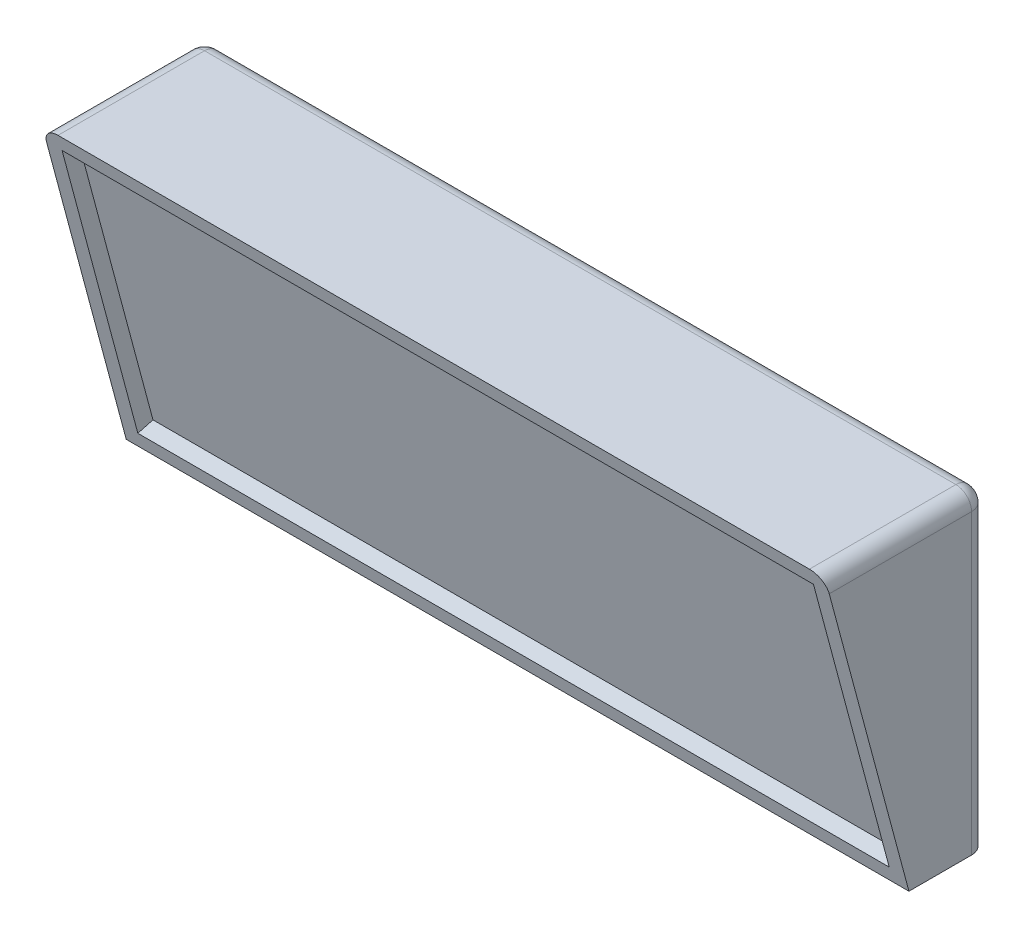
ISO-10303-21;
HEADER;
FILE_DESCRIPTION(('STEP AP214'),'2;1');
FILE_NAME('part.step','',(''),(''),'','','');
FILE_SCHEMA(('AUTOMOTIVE_DESIGN { 1 0 10303 214 1 1 1 1 }'));
ENDSEC;
DATA;
#1=APPLICATION_CONTEXT('core data for automotive mechanical design processes');
#2=APPLICATION_PROTOCOL_DEFINITION('international standard','automotive_design',2000,#1);
#3=PRODUCT_CONTEXT('',#1,'mechanical');
#4=PRODUCT('Part','Part','',(#3));
#5=PRODUCT_RELATED_PRODUCT_CATEGORY('part','',(#4));
#6=PRODUCT_DEFINITION_FORMATION('','',#4);
#7=PRODUCT_DEFINITION_CONTEXT('part definition',#1,'design');
#8=PRODUCT_DEFINITION('design','',#6,#7);
#9=PRODUCT_DEFINITION_SHAPE('','',#8);
#10=(LENGTH_UNIT() NAMED_UNIT(*) SI_UNIT(.MILLI.,.METRE.));
#11=(NAMED_UNIT(*) PLANE_ANGLE_UNIT() SI_UNIT($,.RADIAN.));
#12=(NAMED_UNIT(*) SI_UNIT($,.STERADIAN.) SOLID_ANGLE_UNIT());
#13=UNCERTAINTY_MEASURE_WITH_UNIT(LENGTH_MEASURE(1.E-05),#10,'distance_accuracy_value','');
#14=(GEOMETRIC_REPRESENTATION_CONTEXT(3) GLOBAL_UNCERTAINTY_ASSIGNED_CONTEXT((#13)) GLOBAL_UNIT_ASSIGNED_CONTEXT((#10,
#11,#12)) REPRESENTATION_CONTEXT('',''));
#15=CARTESIAN_POINT('',(0.,0.,0.));
#16=DIRECTION('',(0.,0.,1.));
#17=DIRECTION('',(1.,0.,0.));
#18=AXIS2_PLACEMENT_3D('',#15,#16,#17);
#19=CARTESIAN_POINT('',(63.5,0.,12.7));
#20=DIRECTION('',(0.,1.,0.));
#21=DIRECTION('',(0.,0.,1.));
#22=AXIS2_PLACEMENT_3D('',#19,#20,#21);
#23=PLANE('',#22);
#24=DIRECTION('',(0.,0.,-1.));
#25=VECTOR('',#24,1.);
#26=CARTESIAN_POINT('',(-63.5,0.,12.7));
#27=LINE('',#26,#25);
#28=CARTESIAN_POINT('',(-63.5,0.,12.7));
#29=VERTEX_POINT('',#28);
#30=CARTESIAN_POINT('',(-63.5,0.,2.54));
#31=VERTEX_POINT('',#30);
#32=EDGE_CURVE('E187',#29,#31,#27,.T.);
#33=ORIENTED_EDGE('',*,*,#32,.T.);
#34=CARTESIAN_POINT('',(-60.96,0.,2.54));
#35=DIRECTION('',(0.,1.,0.));
#36=DIRECTION('',(0.,0.,1.));
#37=AXIS2_PLACEMENT_3D('',#34,#35,#36);
#38=CIRCLE('',#37,2.54);
#39=CARTESIAN_POINT('',(-60.96,0.,0.));
#40=VERTEX_POINT('',#39);
#41=EDGE_CURVE('E237',#31,#40,#38,.F.);
#42=ORIENTED_EDGE('',*,*,#41,.T.);
#43=DIRECTION('',(-1.,0.,0.));
#44=VECTOR('',#43,1.);
#45=CARTESIAN_POINT('',(63.5,0.,0.));
#46=LINE('',#45,#44);
#47=CARTESIAN_POINT('',(60.96,0.,0.));
#48=VERTEX_POINT('',#47);
#49=EDGE_CURVE('E214',#48,#40,#46,.T.);
#50=ORIENTED_EDGE('',*,*,#49,.F.);
#51=CARTESIAN_POINT('',(60.96,0.,2.54));
#52=DIRECTION('',(0.,1.,0.));
#53=DIRECTION('',(0.,0.,1.));
#54=AXIS2_PLACEMENT_3D('',#51,#52,#53);
#55=CIRCLE('',#54,2.54);
#56=CARTESIAN_POINT('',(63.5,0.,2.54));
#57=VERTEX_POINT('',#56);
#58=EDGE_CURVE('E234',#48,#57,#55,.F.);
#59=ORIENTED_EDGE('',*,*,#58,.T.);
#60=DIRECTION('',(0.,0.,-1.));
#61=VECTOR('',#60,1.);
#62=CARTESIAN_POINT('',(63.5,0.,12.7));
#63=LINE('',#62,#61);
#64=CARTESIAN_POINT('',(63.5,0.,12.7));
#65=VERTEX_POINT('',#64);
#66=EDGE_CURVE('E193',#65,#57,#63,.T.);
#67=ORIENTED_EDGE('',*,*,#66,.F.);
#68=DIRECTION('',(-1.,0.,0.));
#69=VECTOR('',#68,1.);
#70=CARTESIAN_POINT('',(63.5,0.,12.7));
#71=LINE('',#70,#69);
#72=EDGE_CURVE('E201',#65,#29,#71,.T.);
#73=ORIENTED_EDGE('',*,*,#72,.T.);
#74=EDGE_LOOP('',(#33,#42,#50,#59,#67,#73));
#75=FACE_BOUND('',#74,.T.);
#76=ADVANCED_FACE('F47',(#75),#23,.F.);
#77=CARTESIAN_POINT('',(63.5,0.,0.));
#78=DIRECTION('',(0.,0.,1.));
#79=DIRECTION('',(1.,0.,0.));
#80=AXIS2_PLACEMENT_3D('',#77,#78,#79);
#81=PLANE('',#80);
#82=ORIENTED_EDGE('',*,*,#49,.T.);
#83=DIRECTION('',(0.,1.,0.));
#84=VECTOR('',#83,1.);
#85=CARTESIAN_POINT('',(-60.96,0.,0.));
#86=LINE('',#85,#84);
#87=CARTESIAN_POINT('',(-60.96,48.26,0.));
#88=VERTEX_POINT('',#87);
#89=EDGE_CURVE('E224',#40,#88,#86,.T.);
#90=ORIENTED_EDGE('',*,*,#89,.T.);
#91=DIRECTION('',(-1.,0.,0.));
#92=VECTOR('',#91,1.);
#93=CARTESIAN_POINT('',(63.5,48.26,0.));
#94=LINE('',#93,#92);
#95=CARTESIAN_POINT('',(60.96,48.26,0.));
#96=VERTEX_POINT('',#95);
#97=EDGE_CURVE('E218',#88,#96,#94,.F.);
#98=ORIENTED_EDGE('',*,*,#97,.T.);
#99=DIRECTION('',(0.,1.,0.));
#100=VECTOR('',#99,1.);
#101=CARTESIAN_POINT('',(60.96,0.,0.));
#102=LINE('',#101,#100);
#103=EDGE_CURVE('E221',#96,#48,#102,.F.);
#104=ORIENTED_EDGE('',*,*,#103,.T.);
#105=EDGE_LOOP('',(#82,#90,#98,#104));
#106=FACE_BOUND('',#105,.T.);
#107=ADVANCED_FACE('F318',(#106),#81,.F.);
#108=CARTESIAN_POINT('',(63.5,50.8,0.));
#109=DIRECTION('',(0.,-1.,0.));
#110=DIRECTION('',(0.,0.,-1.));
#111=AXIS2_PLACEMENT_3D('',#108,#109,#110);
#112=PLANE('',#111);
#113=DIRECTION('',(-1.,0.,0.));
#114=VECTOR('',#113,1.);
#115=CARTESIAN_POINT('',(63.5,50.8,2.54));
#116=LINE('',#115,#114);
#117=CARTESIAN_POINT('',(60.96,50.8,2.54));
#118=VERTEX_POINT('',#117);
#119=CARTESIAN_POINT('',(-60.96,50.8,2.54));
#120=VERTEX_POINT('',#119);
#121=EDGE_CURVE('E65',#118,#120,#116,.T.);
#122=ORIENTED_EDGE('',*,*,#121,.T.);
#123=DIRECTION('',(0.,0.,1.));
#124=VECTOR('',#123,1.);
#125=CARTESIAN_POINT('',(-60.96,50.8,0.));
#126=LINE('',#125,#124);
#127=CARTESIAN_POINT('',(-60.96,50.8,26.3118189755013));
#128=VERTEX_POINT('',#127);
#129=EDGE_CURVE('E250',#120,#128,#126,.T.);
#130=ORIENTED_EDGE('',*,*,#129,.T.);
#131=DIRECTION('',(-1.,0.,0.));
#132=VECTOR('',#131,1.);
#133=CARTESIAN_POINT('',(63.5,50.8,26.3118189755013));
#134=LINE('',#133,#132);
#135=CARTESIAN_POINT('',(60.96,50.8,26.3118189755013));
#136=VERTEX_POINT('',#135);
#137=EDGE_CURVE('E210',#136,#128,#134,.T.);
#138=ORIENTED_EDGE('',*,*,#137,.F.);
#139=DIRECTION('',(0.,0.,1.));
#140=VECTOR('',#139,1.);
#141=CARTESIAN_POINT('',(60.96,50.8,0.));
#142=LINE('',#141,#140);
#143=EDGE_CURVE('E70',#136,#118,#142,.F.);
#144=ORIENTED_EDGE('',*,*,#143,.T.);
#145=EDGE_LOOP('',(#122,#130,#138,#144));
#146=FACE_BOUND('',#145,.T.);
#147=ADVANCED_FACE('F310',(#146),#112,.F.);
#148=CARTESIAN_POINT('',(63.5,50.8,26.3118189755013));
#149=DIRECTION('',(0.,0.258819045102525,-0.965925826289067));
#150=DIRECTION('',(0.,0.965925826289067,0.258819045102525));
#151=AXIS2_PLACEMENT_3D('',#148,#149,#150);
#152=PLANE('',#151);
#153=DIRECTION('',(0.,-0.965925826289067,-0.258819045102525));
#154=VECTOR('',#153,1.);
#155=CARTESIAN_POINT('',(-60.96,48.3465484012258,25.6544186009409));
#156=LINE('',#155,#154);
#157=CARTESIAN_POINT('',(-60.96,48.3465484012258,25.6544186009409));
#158=VERTEX_POINT('',#157);
#159=CARTESIAN_POINT('',(-60.96,2.45345159877423,13.3574003745604));
#160=VERTEX_POINT('',#159);
#161=EDGE_CURVE('E178',#158,#160,#156,.T.);
#162=ORIENTED_EDGE('',*,*,#161,.F.);
#163=DIRECTION('',(-1.,0.,0.));
#164=VECTOR('',#163,1.);
#165=CARTESIAN_POINT('',(60.96,48.3465484012258,25.6544186009409));
#166=LINE('',#165,#164);
#167=CARTESIAN_POINT('',(60.96,48.3465484012258,25.6544186009409));
#168=VERTEX_POINT('',#167);
#169=EDGE_CURVE('E145',#168,#158,#166,.T.);
#170=ORIENTED_EDGE('',*,*,#169,.F.);
#171=DIRECTION('',(0.,0.965925826289067,0.258819045102525));
#172=VECTOR('',#171,1.);
#173=CARTESIAN_POINT('',(60.96,2.45345159877423,13.3574003745604));
#174=LINE('',#173,#172);
#175=CARTESIAN_POINT('',(60.96,2.45345159877423,13.3574003745604));
#176=VERTEX_POINT('',#175);
#177=EDGE_CURVE('E165',#176,#168,#174,.T.);
#178=ORIENTED_EDGE('',*,*,#177,.F.);
#179=DIRECTION('',(1.,0.,0.));
#180=VECTOR('',#179,1.);
#181=CARTESIAN_POINT('',(-60.96,2.45345159877423,13.3574003745604));
#182=LINE('',#181,#180);
#183=EDGE_CURVE('E169',#160,#176,#182,.T.);
#184=ORIENTED_EDGE('',*,*,#183,.F.);
#185=EDGE_LOOP('',(#162,#170,#178,#184));
#186=FACE_BOUND('',#185,.T.);
#187=ORIENTED_EDGE('',*,*,#137,.T.);
#188=CARTESIAN_POINT('',(-60.96,48.26,25.6312280267262));
#189=DIRECTION('',(0.,0.258819045102525,-0.965925826289067));
#190=DIRECTION('',(0.,0.965925826289067,0.258819045102525));
#191=AXIS2_PLACEMENT_3D('',#188,#189,#190);
#192=ELLIPSE('',#191,2.62960149824161,2.54);
#193=CARTESIAN_POINT('',(-63.5,48.26,25.6312280267262));
#194=VERTEX_POINT('',#193);
#195=EDGE_CURVE('E11',#128,#194,#192,.F.);
#196=ORIENTED_EDGE('',*,*,#195,.T.);
#197=DIRECTION('',(0.,-0.965925826289067,-0.258819045102525));
#198=VECTOR('',#197,1.);
#199=CARTESIAN_POINT('',(-63.5,50.8,26.3118189755013));
#200=LINE('',#199,#198);
#201=EDGE_CURVE('E198',#194,#29,#200,.T.);
#202=ORIENTED_EDGE('',*,*,#201,.T.);
#203=ORIENTED_EDGE('',*,*,#72,.F.);
#204=DIRECTION('',(0.,-0.965925826289067,-0.258819045102525));
#205=VECTOR('',#204,1.);
#206=CARTESIAN_POINT('',(63.5,50.8,26.3118189755013));
#207=LINE('',#206,#205);
#208=CARTESIAN_POINT('',(63.5,48.26,25.6312280267262));
#209=VERTEX_POINT('',#208);
#210=EDGE_CURVE('E197',#209,#65,#207,.T.);
#211=ORIENTED_EDGE('',*,*,#210,.F.);
#212=CARTESIAN_POINT('',(60.96,48.26,25.6312280267262));
#213=DIRECTION('',(0.,0.258819045102525,-0.965925826289067));
#214=DIRECTION('',(0.,-0.965925826289067,-0.258819045102525));
#215=AXIS2_PLACEMENT_3D('',#212,#213,#214);
#216=ELLIPSE('',#215,2.62960149824161,2.54);
#217=EDGE_CURVE('E57',#209,#136,#216,.F.);
#218=ORIENTED_EDGE('',*,*,#217,.T.);
#219=EDGE_LOOP('',(#187,#196,#202,#203,#211,#218));
#220=FACE_BOUND('',#219,.T.);
#221=ADVANCED_FACE('F308',(#186,#220),#152,.F.);
#222=CARTESIAN_POINT('',(63.5,0.,0.));
#223=DIRECTION('',(1.,0.,0.));
#224=DIRECTION('',(0.,0.,-1.));
#225=AXIS2_PLACEMENT_3D('',#222,#223,#224);
#226=PLANE('',#225);
#227=ORIENTED_EDGE('',*,*,#66,.T.);
#228=DIRECTION('',(0.,1.,0.));
#229=VECTOR('',#228,1.);
#230=CARTESIAN_POINT('',(63.5,50.8,2.54));
#231=LINE('',#230,#229);
#232=CARTESIAN_POINT('',(63.5,48.26,2.54));
#233=VERTEX_POINT('',#232);
#234=EDGE_CURVE('E243',#57,#233,#231,.T.);
#235=ORIENTED_EDGE('',*,*,#234,.T.);
#236=DIRECTION('',(0.,0.,1.));
#237=VECTOR('',#236,1.);
#238=CARTESIAN_POINT('',(63.5,48.26,26.3118189755013));
#239=LINE('',#238,#237);
#240=EDGE_CURVE('E240',#233,#209,#239,.T.);
#241=ORIENTED_EDGE('',*,*,#240,.T.);
#242=ORIENTED_EDGE('',*,*,#210,.T.);
#243=EDGE_LOOP('',(#227,#235,#241,#242));
#244=FACE_BOUND('',#243,.T.);
#245=ADVANCED_FACE('F315',(#244),#226,.T.);
#246=CARTESIAN_POINT('',(-63.5,0.,0.));
#247=DIRECTION('',(1.,0.,0.));
#248=DIRECTION('',(0.,0.,-1.));
#249=AXIS2_PLACEMENT_3D('',#246,#247,#248);
#250=PLANE('',#249);
#251=DIRECTION('',(0.,0.,1.));
#252=VECTOR('',#251,1.);
#253=CARTESIAN_POINT('',(-63.5,48.26,0.));
#254=LINE('',#253,#252);
#255=CARTESIAN_POINT('',(-63.5,48.26,2.54));
#256=VERTEX_POINT('',#255);
#257=EDGE_CURVE('E228',#194,#256,#254,.F.);
#258=ORIENTED_EDGE('',*,*,#257,.T.);
#259=DIRECTION('',(0.,1.,0.));
#260=VECTOR('',#259,1.);
#261=CARTESIAN_POINT('',(-63.5,0.,2.54));
#262=LINE('',#261,#260);
#263=EDGE_CURVE('E231',#256,#31,#262,.F.);
#264=ORIENTED_EDGE('',*,*,#263,.T.);
#265=ORIENTED_EDGE('',*,*,#32,.F.);
#266=ORIENTED_EDGE('',*,*,#201,.F.);
#267=EDGE_LOOP('',(#258,#264,#265,#266));
#268=FACE_BOUND('',#267,.T.);
#269=ADVANCED_FACE('F300',(#268),#250,.F.);
#270=CARTESIAN_POINT('',(60.96,49.0039487757862,23.2009670021666));
#271=DIRECTION('',(0.,0.965925826289067,0.258819045102525));
#272=DIRECTION('',(0.,-0.258819045102525,0.965925826289067));
#273=AXIS2_PLACEMENT_3D('',#270,#271,#272);
#274=PLANE('',#273);
#275=ORIENTED_EDGE('',*,*,#169,.T.);
#276=DIRECTION('',(0.,-0.258819045102525,0.965925826289067));
#277=VECTOR('',#276,1.);
#278=CARTESIAN_POINT('',(-60.96,49.0039487757862,23.2009670021666));
#279=LINE('',#278,#277);
#280=CARTESIAN_POINT('',(-60.96,49.0039487757862,23.2009670021666));
#281=VERTEX_POINT('',#280);
#282=EDGE_CURVE('E138',#281,#158,#279,.T.);
#283=ORIENTED_EDGE('',*,*,#282,.F.);
#284=DIRECTION('',(-1.,0.,0.));
#285=VECTOR('',#284,1.);
#286=CARTESIAN_POINT('',(60.96,49.0039487757862,23.2009670021666));
#287=LINE('',#286,#285);
#288=CARTESIAN_POINT('',(60.96,49.0039487757862,23.2009670021666));
#289=VERTEX_POINT('',#288);
#290=EDGE_CURVE('E142',#289,#281,#287,.T.);
#291=ORIENTED_EDGE('',*,*,#290,.F.);
#292=DIRECTION('',(0.,-0.258819045102525,0.965925826289067));
#293=VECTOR('',#292,1.);
#294=CARTESIAN_POINT('',(60.96,49.0039487757862,23.2009670021666));
#295=LINE('',#294,#293);
#296=EDGE_CURVE('E184',#289,#168,#295,.T.);
#297=ORIENTED_EDGE('',*,*,#296,.T.);
#298=EDGE_LOOP('',(#275,#283,#291,#297));
#299=FACE_BOUND('',#298,.T.);
#300=ADVANCED_FACE('F140',(#299),#274,.F.);
#301=CARTESIAN_POINT('',(60.96,3.11085197333464,10.9039487757862));
#302=DIRECTION('',(1.,0.,0.));
#303=DIRECTION('',(0.,0.,-1.));
#304=AXIS2_PLACEMENT_3D('',#301,#302,#303);
#305=PLANE('',#304);
#306=ORIENTED_EDGE('',*,*,#177,.T.);
#307=ORIENTED_EDGE('',*,*,#296,.F.);
#308=DIRECTION('',(0.,0.965925826289067,0.258819045102525));
#309=VECTOR('',#308,1.);
#310=CARTESIAN_POINT('',(60.96,3.11085197333464,10.9039487757862));
#311=LINE('',#310,#309);
#312=CARTESIAN_POINT('',(60.96,3.11085197333464,10.9039487757862));
#313=VERTEX_POINT('',#312);
#314=EDGE_CURVE('E151',#313,#289,#311,.T.);
#315=ORIENTED_EDGE('',*,*,#314,.F.);
#316=DIRECTION('',(0.,-0.258819045102525,0.965925826289067));
#317=VECTOR('',#316,1.);
#318=CARTESIAN_POINT('',(60.96,3.11085197333464,10.9039487757862));
#319=LINE('',#318,#317);
#320=EDGE_CURVE('E188',#313,#176,#319,.T.);
#321=ORIENTED_EDGE('',*,*,#320,.T.);
#322=EDGE_LOOP('',(#306,#307,#315,#321));
#323=FACE_BOUND('',#322,.T.);
#324=ADVANCED_FACE('F352',(#323),#305,.F.);
#325=CARTESIAN_POINT('',(-60.96,3.11085197333464,10.9039487757862));
#326=DIRECTION('',(0.,-0.965925826289067,-0.258819045102525));
#327=DIRECTION('',(0.,0.258819045102525,-0.965925826289067));
#328=AXIS2_PLACEMENT_3D('',#325,#326,#327);
#329=PLANE('',#328);
#330=ORIENTED_EDGE('',*,*,#183,.T.);
#331=ORIENTED_EDGE('',*,*,#320,.F.);
#332=DIRECTION('',(1.,0.,0.));
#333=VECTOR('',#332,1.);
#334=CARTESIAN_POINT('',(-60.96,3.11085197333464,10.9039487757862));
#335=LINE('',#334,#333);
#336=CARTESIAN_POINT('',(-60.96,3.11085197333464,10.9039487757862));
#337=VERTEX_POINT('',#336);
#338=EDGE_CURVE('E160',#337,#313,#335,.T.);
#339=ORIENTED_EDGE('',*,*,#338,.F.);
#340=DIRECTION('',(0.,-0.258819045102525,0.965925826289067));
#341=VECTOR('',#340,1.);
#342=CARTESIAN_POINT('',(-60.96,3.11085197333464,10.9039487757862));
#343=LINE('',#342,#341);
#344=EDGE_CURVE('E150',#337,#160,#343,.T.);
#345=ORIENTED_EDGE('',*,*,#344,.T.);
#346=EDGE_LOOP('',(#330,#331,#339,#345));
#347=FACE_BOUND('',#346,.T.);
#348=ADVANCED_FACE('F349',(#347),#329,.F.);
#349=CARTESIAN_POINT('',(-60.96,49.0039487757862,23.2009670021666));
#350=DIRECTION('',(-1.,0.,0.));
#351=DIRECTION('',(0.,0.,1.));
#352=AXIS2_PLACEMENT_3D('',#349,#350,#351);
#353=PLANE('',#352);
#354=ORIENTED_EDGE('',*,*,#161,.T.);
#355=ORIENTED_EDGE('',*,*,#344,.F.);
#356=DIRECTION('',(0.,-0.965925826289067,-0.258819045102525));
#357=VECTOR('',#356,1.);
#358=CARTESIAN_POINT('',(-60.96,49.0039487757862,23.2009670021666));
#359=LINE('',#358,#357);
#360=EDGE_CURVE('E154',#281,#337,#359,.T.);
#361=ORIENTED_EDGE('',*,*,#360,.F.);
#362=ORIENTED_EDGE('',*,*,#282,.T.);
#363=EDGE_LOOP('',(#354,#355,#361,#362));
#364=FACE_BOUND('',#363,.T.);
#365=ADVANCED_FACE('F155',(#364),#353,.F.);
#366=CARTESIAN_POINT('',(0.,-2.51759962543964,9.39580971525693));
#367=DIRECTION('',(0.,-0.258819045102525,0.965925826289067));
#368=DIRECTION('',(0.,-0.965925826289067,-0.258819045102525));
#369=AXIS2_PLACEMENT_3D('',#366,#367,#368);
#370=PLANE('',#369);
#371=ORIENTED_EDGE('',*,*,#290,.T.);
#372=ORIENTED_EDGE('',*,*,#360,.T.);
#373=ORIENTED_EDGE('',*,*,#338,.T.);
#374=ORIENTED_EDGE('',*,*,#314,.T.);
#375=EDGE_LOOP('',(#371,#372,#373,#374));
#376=FACE_BOUND('',#375,.T.);
#377=ADVANCED_FACE('F162',(#376),#370,.T.);
#378=CARTESIAN_POINT('',(60.96,0.,2.54));
#379=DIRECTION('',(0.,-1.,0.));
#380=DIRECTION('',(0.,0.,-1.));
#381=AXIS2_PLACEMENT_3D('',#378,#379,#380);
#382=CYLINDRICAL_SURFACE('',#381,2.54);
#383=ORIENTED_EDGE('',*,*,#58,.F.);
#384=ORIENTED_EDGE('',*,*,#103,.F.);
#385=CARTESIAN_POINT('',(60.96,48.26,2.54));
#386=DIRECTION('',(0.,1.,0.));
#387=DIRECTION('',(0.,0.,1.));
#388=AXIS2_PLACEMENT_3D('',#385,#386,#387);
#389=CIRCLE('',#388,2.54);
#390=EDGE_CURVE('E51',#233,#96,#389,.T.);
#391=ORIENTED_EDGE('',*,*,#390,.F.);
#392=ORIENTED_EDGE('',*,*,#234,.F.);
#393=EDGE_LOOP('',(#383,#384,#391,#392));
#394=FACE_BOUND('',#393,.T.);
#395=ADVANCED_FACE('F49',(#394),#382,.T.);
#396=CARTESIAN_POINT('',(60.96,48.26,0.));
#397=DIRECTION('',(0.,0.,-1.));
#398=DIRECTION('',(-1.,0.,0.));
#399=AXIS2_PLACEMENT_3D('',#396,#397,#398);
#400=CYLINDRICAL_SURFACE('',#399,2.54);
#401=ORIENTED_EDGE('',*,*,#217,.F.);
#402=ORIENTED_EDGE('',*,*,#240,.F.);
#403=CARTESIAN_POINT('',(60.96,48.26,2.54));
#404=DIRECTION('',(0.,0.,-1.));
#405=DIRECTION('',(-1.,0.,0.));
#406=AXIS2_PLACEMENT_3D('',#403,#404,#405);
#407=CIRCLE('',#406,2.54);
#408=EDGE_CURVE('E269',#118,#233,#407,.T.);
#409=ORIENTED_EDGE('',*,*,#408,.F.);
#410=ORIENTED_EDGE('',*,*,#143,.F.);
#411=EDGE_LOOP('',(#401,#402,#409,#410));
#412=FACE_BOUND('',#411,.T.);
#413=ADVANCED_FACE('F312',(#412),#400,.T.);
#414=CARTESIAN_POINT('',(60.96,48.26,2.54));
#415=DIRECTION('',(1.,0.,0.));
#416=DIRECTION('',(0.,0.,-1.));
#417=AXIS2_PLACEMENT_3D('',#414,#415,#416);
#418=SPHERICAL_SURFACE('',#417,2.54);
#419=ORIENTED_EDGE('',*,*,#408,.T.);
#420=ORIENTED_EDGE('',*,*,#390,.T.);
#421=CARTESIAN_POINT('',(60.96,48.26,2.54));
#422=DIRECTION('',(1.,0.,0.));
#423=DIRECTION('',(0.,0.,-1.));
#424=AXIS2_PLACEMENT_3D('',#421,#422,#423);
#425=CIRCLE('',#424,2.54);
#426=EDGE_CURVE('E266',#118,#96,#425,.F.);
#427=ORIENTED_EDGE('',*,*,#426,.F.);
#428=EDGE_LOOP('',(#419,#420,#427));
#429=FACE_BOUND('',#428,.T.);
#430=ADVANCED_FACE('F277',(#429),#418,.T.);
#431=CARTESIAN_POINT('',(63.5,48.26,2.54));
#432=DIRECTION('',(-1.,0.,0.));
#433=DIRECTION('',(0.,0.,1.));
#434=AXIS2_PLACEMENT_3D('',#431,#432,#433);
#435=CYLINDRICAL_SURFACE('',#434,2.54);
#436=ORIENTED_EDGE('',*,*,#426,.T.);
#437=ORIENTED_EDGE('',*,*,#97,.F.);
#438=CARTESIAN_POINT('',(-60.96,48.26,2.54));
#439=DIRECTION('',(-1.,0.,0.));
#440=DIRECTION('',(0.,0.,1.));
#441=AXIS2_PLACEMENT_3D('',#438,#439,#440);
#442=CIRCLE('',#441,2.54);
#443=EDGE_CURVE('E262',#120,#88,#442,.T.);
#444=ORIENTED_EDGE('',*,*,#443,.F.);
#445=ORIENTED_EDGE('',*,*,#121,.F.);
#446=EDGE_LOOP('',(#436,#437,#444,#445));
#447=FACE_BOUND('',#446,.T.);
#448=ADVANCED_FACE('F283',(#447),#435,.T.);
#449=CARTESIAN_POINT('',(-60.96,48.26,0.));
#450=DIRECTION('',(0.,0.,1.));
#451=DIRECTION('',(1.,0.,0.));
#452=AXIS2_PLACEMENT_3D('',#449,#450,#451);
#453=CYLINDRICAL_SURFACE('',#452,2.54);
#454=ORIENTED_EDGE('',*,*,#195,.F.);
#455=ORIENTED_EDGE('',*,*,#129,.F.);
#456=CARTESIAN_POINT('',(-60.96,48.26,2.54));
#457=DIRECTION('',(0.,0.,-1.));
#458=DIRECTION('',(-1.,0.,0.));
#459=AXIS2_PLACEMENT_3D('',#456,#457,#458);
#460=CIRCLE('',#459,2.54);
#461=EDGE_CURVE('E258',#256,#120,#460,.T.);
#462=ORIENTED_EDGE('',*,*,#461,.F.);
#463=ORIENTED_EDGE('',*,*,#257,.F.);
#464=EDGE_LOOP('',(#454,#455,#462,#463));
#465=FACE_BOUND('',#464,.T.);
#466=ADVANCED_FACE('F293',(#465),#453,.T.);
#467=CARTESIAN_POINT('',(-60.96,48.26,2.54));
#468=DIRECTION('',(0.,1.,0.));
#469=DIRECTION('',(0.,0.,1.));
#470=AXIS2_PLACEMENT_3D('',#467,#468,#469);
#471=SPHERICAL_SURFACE('',#470,2.54);
#472=ORIENTED_EDGE('',*,*,#461,.T.);
#473=ORIENTED_EDGE('',*,*,#443,.T.);
#474=CARTESIAN_POINT('',(-60.96,48.26,2.54));
#475=DIRECTION('',(0.,1.,0.));
#476=DIRECTION('',(0.,0.,1.));
#477=AXIS2_PLACEMENT_3D('',#474,#475,#476);
#478=CIRCLE('',#477,2.54);
#479=EDGE_CURVE('E255',#256,#88,#478,.F.);
#480=ORIENTED_EDGE('',*,*,#479,.F.);
#481=EDGE_LOOP('',(#472,#473,#480));
#482=FACE_BOUND('',#481,.T.);
#483=ADVANCED_FACE('F288',(#482),#471,.T.);
#484=CARTESIAN_POINT('',(-60.96,0.,2.54));
#485=DIRECTION('',(0.,1.,0.));
#486=DIRECTION('',(0.,0.,1.));
#487=AXIS2_PLACEMENT_3D('',#484,#485,#486);
#488=CYLINDRICAL_SURFACE('',#487,2.54);
#489=ORIENTED_EDGE('',*,*,#41,.F.);
#490=ORIENTED_EDGE('',*,*,#263,.F.);
#491=ORIENTED_EDGE('',*,*,#479,.T.);
#492=ORIENTED_EDGE('',*,*,#89,.F.);
#493=EDGE_LOOP('',(#489,#490,#491,#492));
#494=FACE_BOUND('',#493,.T.);
#495=ADVANCED_FACE('F296',(#494),#488,.T.);
#496=CLOSED_SHELL('',(#76,#107,#147,#221,#245,#269,#300,#324,#348,#365,#377,#395,#413,#430,#448,
#466,#483,#495));
#497=MANIFOLD_SOLID_BREP('B2',#496);
#498=ADVANCED_BREP_SHAPE_REPRESENTATION('',(#18,#497),#14);
#499=SHAPE_DEFINITION_REPRESENTATION(#9,#498);
ENDSEC;
END-ISO-10303-21;
